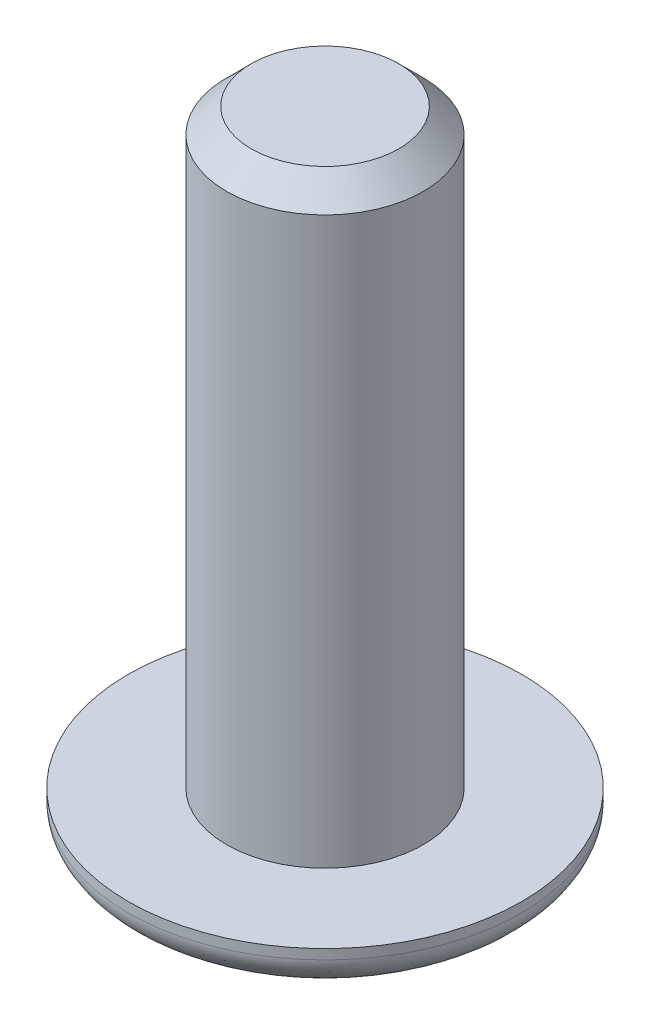
ISO-10303-21;
HEADER;
FILE_DESCRIPTION(('STEP AP214'),'2;1');
FILE_NAME('part.step','',(''),(''),'','','');
FILE_SCHEMA(('AUTOMOTIVE_DESIGN { 1 0 10303 214 1 1 1 1 }'));
ENDSEC;
DATA;
#1=APPLICATION_CONTEXT('core data for automotive mechanical design processes');
#2=APPLICATION_PROTOCOL_DEFINITION('international standard','automotive_design',2000,#1);
#3=PRODUCT_CONTEXT('',#1,'mechanical');
#4=PRODUCT('Part','Part','',(#3));
#5=PRODUCT_RELATED_PRODUCT_CATEGORY('part','',(#4));
#6=PRODUCT_DEFINITION_FORMATION('','',#4);
#7=PRODUCT_DEFINITION_CONTEXT('part definition',#1,'design');
#8=PRODUCT_DEFINITION('design','',#6,#7);
#9=PRODUCT_DEFINITION_SHAPE('','',#8);
#10=(LENGTH_UNIT() NAMED_UNIT(*) SI_UNIT(.MILLI.,.METRE.));
#11=(NAMED_UNIT(*) PLANE_ANGLE_UNIT() SI_UNIT($,.RADIAN.));
#12=(NAMED_UNIT(*) SI_UNIT($,.STERADIAN.) SOLID_ANGLE_UNIT());
#13=UNCERTAINTY_MEASURE_WITH_UNIT(LENGTH_MEASURE(1.E-05),#10,'distance_accuracy_value','');
#14=(GEOMETRIC_REPRESENTATION_CONTEXT(3) GLOBAL_UNCERTAINTY_ASSIGNED_CONTEXT((#13)) GLOBAL_UNIT_ASSIGNED_CONTEXT((#10,
#11,#12)) REPRESENTATION_CONTEXT('',''));
#15=CARTESIAN_POINT('',(0.,0.,0.));
#16=DIRECTION('',(0.,0.,1.));
#17=DIRECTION('',(1.,0.,0.));
#18=AXIS2_PLACEMENT_3D('',#15,#16,#17);
#19=CARTESIAN_POINT('',(0.,1.2,0.));
#20=DIRECTION('',(0.,1.,0.));
#21=DIRECTION('',(0.,0.,1.));
#22=AXIS2_PLACEMENT_3D('',#19,#20,#21);
#23=PLANE('',#22);
#24=CARTESIAN_POINT('',(0.,1.2,0.));
#25=DIRECTION('',(0.,1.,0.));
#26=DIRECTION('',(0.,0.,1.));
#27=AXIS2_PLACEMENT_3D('',#24,#25,#26);
#28=CIRCLE('',#27,2.);
#29=CARTESIAN_POINT('',(0.,1.2,2.));
#30=VERTEX_POINT('',#29);
#31=EDGE_CURVE('E297',#30,#30,#28,.T.);
#32=ORIENTED_EDGE('',*,*,#31,.F.);
#33=EDGE_LOOP('',(#32));
#34=FACE_BOUND('',#33,.T.);
#35=CARTESIAN_POINT('',(0.,1.2,0.));
#36=DIRECTION('',(0.,1.,0.));
#37=DIRECTION('',(0.,0.,1.));
#38=AXIS2_PLACEMENT_3D('',#35,#36,#37);
#39=CIRCLE('',#38,4.);
#40=CARTESIAN_POINT('',(0.,1.2,4.));
#41=VERTEX_POINT('',#40);
#42=EDGE_CURVE('E136',#41,#41,#39,.T.);
#43=ORIENTED_EDGE('',*,*,#42,.T.);
#44=EDGE_LOOP('',(#43));
#45=FACE_BOUND('',#44,.T.);
#46=ADVANCED_FACE('F41',(#34,#45),#23,.T.);
#47=CARTESIAN_POINT('',(0.,0.,0.));
#48=DIRECTION('',(0.,1.,0.));
#49=DIRECTION('',(0.,0.,1.));
#50=AXIS2_PLACEMENT_3D('',#47,#48,#49);
#51=PLANE('',#50);
#52=CARTESIAN_POINT('',(0.,0.,2.));
#53=CARTESIAN_POINT('',(0.261799376890833,0.,2.));
#54=CARTESIAN_POINT('',(0.523495778796538,0.,1.94794534916224));
#55=CARTESIAN_POINT('',(1.00723795066382,0.,1.74757278088291));
#56=CARTESIAN_POINT('',(1.22909344766315,0.,1.59933367708304));
#57=CARTESIAN_POINT('',(1.59933367708304,0.,1.22909344766315));
#58=CARTESIAN_POINT('',(1.74757278088293,0.,1.00723795066385));
#59=CARTESIAN_POINT('',(1.94794534916222,0.,0.52349577879651));
#60=CARTESIAN_POINT('',(2.,0.,0.261799376890842));
#61=CARTESIAN_POINT('',(2.,0.,-0.261799376890842));
#62=CARTESIAN_POINT('',(1.94794534916225,0.,-0.52349577879654));
#63=CARTESIAN_POINT('',(1.7475727808829,0.,-1.00723795066382));
#64=CARTESIAN_POINT('',(1.59933367708301,0.,-1.22909344766318));
#65=CARTESIAN_POINT('',(1.22909344766318,0.,-1.59933367708301));
#66=CARTESIAN_POINT('',(1.00723795066384,0.,-1.74757278088294));
#67=CARTESIAN_POINT('',(0.523495778796522,0.,-1.9479453491622));
#68=CARTESIAN_POINT('',(0.261799376890842,0.,-2.));
#69=CARTESIAN_POINT('',(-0.261799376890842,0.,-2.));
#70=CARTESIAN_POINT('',(-0.523495778796517,0.,-1.94794534916223));
#71=CARTESIAN_POINT('',(-1.00723795066384,0.,-1.74757278088292));
#72=CARTESIAN_POINT('',(-1.22909344766315,0.,-1.59933367708304));
#73=CARTESIAN_POINT('',(-1.59933367708304,0.,-1.22909344766315));
#74=CARTESIAN_POINT('',(-1.74757278088294,0.,-1.00723795066386));
#75=CARTESIAN_POINT('',(-1.94794534916221,0.,-0.523495778796506));
#76=CARTESIAN_POINT('',(-2.,0.,-0.261799376890839));
#77=CARTESIAN_POINT('',(-2.,0.,0.261799376890845));
#78=CARTESIAN_POINT('',(-1.94794534916221,0.,0.523495778796514));
#79=CARTESIAN_POINT('',(-1.74757278088294,0.,1.00723795066384));
#80=CARTESIAN_POINT('',(-1.59933367708301,0.,1.22909344766318));
#81=CARTESIAN_POINT('',(-1.22909344766319,0.,1.599333677083));
#82=CARTESIAN_POINT('',(-1.00723795066384,0.,1.74757278088294));
#83=CARTESIAN_POINT('',(-0.52349577879652,0.,1.94794534916221));
#84=CARTESIAN_POINT('',(-0.261799376890834,0.,2.));
#85=CARTESIAN_POINT('',(0.,0.,2.));
#86=(BOUNDED_CURVE() B_SPLINE_CURVE(3,(#52,#53,#54,#55,#56,#57,#58,#59,#60,#61,#62,#63,#64,#65,
#66,#67,#68,#69,#70,#71,#72,#73,#74,#75,#76,#77,#78,#79,#80,#81,#82,#83,#84,#85),.UNSPECIFIED.,
.T.,.F.) B_SPLINE_CURVE_WITH_KNOTS((4,2,2,2,2,2,2,2,2,2,2,2,2,2,2,2,4),(0.,0.392699081698724,
0.785398163397448,1.17809724509617,1.5707963267949,1.96349540849362,2.35619449019234,
2.74889357189107,3.14159265358979,3.53429173528852,3.92699081698724,4.31968989868597,
4.71238898038469,5.10508806208341,5.49778714378214,5.89048622548086,6.28318530717959),
.UNSPECIFIED.) CURVE() GEOMETRIC_REPRESENTATION_ITEM() RATIONAL_B_SPLINE_CURVE((1.,1.,1.,1.,1.,
1.,1.,1.,1.,1.,1.,1.,1.,1.,1.,1.,1.,1.,1.,1.,1.,1.,1.,1.,1.,1.,1.,1.,1.,1.,1.,1.,1.,1.)) REPRESENTATION_ITEM(''));
#87=CARTESIAN_POINT('',(0.,0.,2.));
#88=VERTEX_POINT('',#87);
#89=EDGE_CURVE('E12',#88,#88,#86,.F.);
#90=ORIENTED_EDGE('',*,*,#89,.T.);
#91=EDGE_LOOP('',(#90));
#92=FACE_BOUND('',#91,.T.);
#93=DIRECTION('',(0.5,0.,-0.866025403784439));
#94=VECTOR('',#93,1.);
#95=CARTESIAN_POINT('',(0.721687836487031,0.,1.25));
#96=LINE('',#95,#94);
#97=CARTESIAN_POINT('',(0.721687836487031,0.,1.25));
#98=VERTEX_POINT('',#97);
#99=CARTESIAN_POINT('',(1.44337567297406,0.,0.));
#100=VERTEX_POINT('',#99);
#101=EDGE_CURVE('E62',#98,#100,#96,.T.);
#102=ORIENTED_EDGE('',*,*,#101,.T.);
#103=DIRECTION('',(-0.5,0.,-0.866025403784439));
#104=VECTOR('',#103,1.);
#105=CARTESIAN_POINT('',(1.44337567297406,0.,0.));
#106=LINE('',#105,#104);
#107=CARTESIAN_POINT('',(0.721687836487031,0.,-1.25));
#108=VERTEX_POINT('',#107);
#109=EDGE_CURVE('E122',#100,#108,#106,.T.);
#110=ORIENTED_EDGE('',*,*,#109,.T.);
#111=DIRECTION('',(-1.,0.,0.));
#112=VECTOR('',#111,1.);
#113=CARTESIAN_POINT('',(0.721687836487031,0.,-1.25));
#114=LINE('',#113,#112);
#115=CARTESIAN_POINT('',(-0.721687836487033,0.,-1.25));
#116=VERTEX_POINT('',#115);
#117=EDGE_CURVE('E120',#108,#116,#114,.T.);
#118=ORIENTED_EDGE('',*,*,#117,.T.);
#119=DIRECTION('',(-0.5,0.,0.866025403784439));
#120=VECTOR('',#119,1.);
#121=CARTESIAN_POINT('',(-0.721687836487033,0.,-1.25));
#122=LINE('',#121,#120);
#123=CARTESIAN_POINT('',(-1.44337567297407,0.,0.));
#124=VERTEX_POINT('',#123);
#125=EDGE_CURVE('E98',#116,#124,#122,.T.);
#126=ORIENTED_EDGE('',*,*,#125,.T.);
#127=DIRECTION('',(0.5,0.,0.866025403784439));
#128=VECTOR('',#127,1.);
#129=CARTESIAN_POINT('',(-1.44337567297407,0.,0.));
#130=LINE('',#129,#128);
#131=CARTESIAN_POINT('',(-0.721687836487033,0.,1.25));
#132=VERTEX_POINT('',#131);
#133=EDGE_CURVE('E109',#124,#132,#130,.T.);
#134=ORIENTED_EDGE('',*,*,#133,.T.);
#135=DIRECTION('',(1.,0.,0.));
#136=VECTOR('',#135,1.);
#137=CARTESIAN_POINT('',(-0.721687836487033,0.,1.25));
#138=LINE('',#137,#136);
#139=EDGE_CURVE('E115',#132,#98,#138,.T.);
#140=ORIENTED_EDGE('',*,*,#139,.T.);
#141=EDGE_LOOP('',(#102,#110,#118,#126,#134,#140));
#142=FACE_BOUND('',#141,.T.);
#143=ADVANCED_FACE('F117',(#92,#142),#51,.F.);
#144=CARTESIAN_POINT('',(0.,1.2,0.));
#145=DIRECTION('',(0.,-1.,0.));
#146=DIRECTION('',(0.,0.,-1.));
#147=AXIS2_PLACEMENT_3D('',#144,#145,#146);
#148=CYLINDRICAL_SURFACE('',#147,4.);
#149=CARTESIAN_POINT('',(0.,1.,4.));
#150=CARTESIAN_POINT('',(-0.523598753781667,1.,4.));
#151=CARTESIAN_POINT('',(-1.04699155759304,1.,3.89589069832441));
#152=CARTESIAN_POINT('',(-2.01447590132769,1.,3.49514556176588));
#153=CARTESIAN_POINT('',(-2.45818689532638,1.,3.198667354166));
#154=CARTESIAN_POINT('',(-3.19866735416602,1.,2.45818689532636));
#155=CARTESIAN_POINT('',(-3.49514556176589,1.,2.01447590132768));
#156=CARTESIAN_POINT('',(-3.89589069832441,1.,1.04699155759303));
#157=CARTESIAN_POINT('',(-4.,1.,0.523598753781691));
#158=CARTESIAN_POINT('',(-4.,1.,-0.523598753781678));
#159=CARTESIAN_POINT('',(-3.89589069832442,1.,-1.04699155759301));
#160=CARTESIAN_POINT('',(-3.49514556176587,1.,-2.01447590132771));
#161=CARTESIAN_POINT('',(-3.19866735416608,1.,-2.4581868953263));
#162=CARTESIAN_POINT('',(-2.4581868953263,1.,-3.19866735416608));
#163=CARTESIAN_POINT('',(-2.01447590132769,1.,-3.49514556176588));
#164=CARTESIAN_POINT('',(-1.04699155759301,1.,-3.89589069832442));
#165=CARTESIAN_POINT('',(-0.523598753781683,1.,-4.));
#166=CARTESIAN_POINT('',(0.523598753781684,1.,-4.));
#167=CARTESIAN_POINT('',(1.04699155759304,1.,-3.89589069832441));
#168=CARTESIAN_POINT('',(2.01447590132768,1.,-3.49514556176588));
#169=CARTESIAN_POINT('',(2.45818689532636,1.,-3.19866735416603));
#170=CARTESIAN_POINT('',(3.19866735416602,1.,-2.45818689532636));
#171=CARTESIAN_POINT('',(3.49514556176589,1.,-2.01447590132768));
#172=CARTESIAN_POINT('',(3.89589069832441,1.,-1.04699155759304));
#173=CARTESIAN_POINT('',(4.,1.,-0.523598753781683));
#174=CARTESIAN_POINT('',(4.,1.,0.523598753781684));
#175=CARTESIAN_POINT('',(3.89589069832442,1.,1.04699155759301));
#176=CARTESIAN_POINT('',(3.49514556176588,1.,2.0144759013277));
#177=CARTESIAN_POINT('',(3.19866735416607,1.,2.45818689532631));
#178=CARTESIAN_POINT('',(2.45818689532631,1.,3.19866735416607));
#179=CARTESIAN_POINT('',(2.01447590132769,1.,3.49514556176588));
#180=CARTESIAN_POINT('',(1.04699155759303,1.,3.89589069832441));
#181=CARTESIAN_POINT('',(0.523598753781667,1.,4.));
#182=CARTESIAN_POINT('',(0.,1.,4.));
#183=(BOUNDED_CURVE() B_SPLINE_CURVE(3,(#149,#150,#151,#152,#153,#154,#155,#156,#157,#158,#159,
#160,#161,#162,#163,#164,#165,#166,#167,#168,#169,#170,#171,#172,#173,#174,#175,#176,#177,#178,
#179,#180,#181,#182),.UNSPECIFIED.,.T.,.F.) B_SPLINE_CURVE_WITH_KNOTS((4,2,2,2,2,2,2,2,2,2,2,2,
2,2,2,2,4),(0.,0.392699081698725,0.785398163397448,1.17809724509617,1.5707963267949,
1.96349540849362,2.35619449019234,2.74889357189107,3.14159265358979,3.53429173528852,
3.92699081698724,4.31968989868597,4.71238898038469,5.10508806208341,5.49778714378214,
5.89048622548086,6.28318530717959),
.UNSPECIFIED.) CURVE() GEOMETRIC_REPRESENTATION_ITEM() RATIONAL_B_SPLINE_CURVE((1.,1.,1.,1.,1.,
1.,1.,1.,1.,1.,1.,1.,1.,1.,1.,1.,1.,1.,1.,1.,1.,1.,1.,1.,1.,1.,1.,1.,1.,1.,1.,1.,1.,1.)) REPRESENTATION_ITEM(''));
#184=CARTESIAN_POINT('',(0.,1.,4.));
#185=VERTEX_POINT('',#184);
#186=EDGE_CURVE('E55',#185,#185,#183,.F.);
#187=ORIENTED_EDGE('',*,*,#186,.T.);
#188=EDGE_LOOP('',(#187));
#189=FACE_BOUND('',#188,.T.);
#190=ORIENTED_EDGE('',*,*,#42,.F.);
#191=EDGE_LOOP('',(#190));
#192=FACE_BOUND('',#191,.T.);
#193=ADVANCED_FACE('F154',(#189,#192),#148,.T.);
#194=CARTESIAN_POINT('',(0.721687836487031,1.2,1.25));
#195=DIRECTION('',(-0.866025403784439,0.,-0.5));
#196=DIRECTION('',(-0.5,0.,0.866025403784439));
#197=AXIS2_PLACEMENT_3D('',#194,#195,#196);
#198=PLANE('',#197);
#199=ORIENTED_EDGE('',*,*,#101,.F.);
#200=DIRECTION('',(0.,-1.,0.));
#201=VECTOR('',#200,1.);
#202=CARTESIAN_POINT('',(0.721687836487031,1.2,1.25));
#203=LINE('',#202,#201);
#204=CARTESIAN_POINT('',(0.721687836487031,1.2,1.25));
#205=VERTEX_POINT('',#204);
#206=EDGE_CURVE('E127',#205,#98,#203,.T.);
#207=ORIENTED_EDGE('',*,*,#206,.F.);
#208=DIRECTION('',(0.5,0.,-0.866025403784439));
#209=VECTOR('',#208,1.);
#210=CARTESIAN_POINT('',(0.721687836487031,1.2,1.25));
#211=LINE('',#210,#209);
#212=CARTESIAN_POINT('',(1.44337567297406,1.2,0.));
#213=VERTEX_POINT('',#212);
#214=EDGE_CURVE('E71',#205,#213,#211,.T.);
#215=ORIENTED_EDGE('',*,*,#214,.T.);
#216=DIRECTION('',(0.,-1.,0.));
#217=VECTOR('',#216,1.);
#218=CARTESIAN_POINT('',(1.44337567297406,1.2,0.));
#219=LINE('',#218,#217);
#220=EDGE_CURVE('E134',#213,#100,#219,.T.);
#221=ORIENTED_EDGE('',*,*,#220,.T.);
#222=EDGE_LOOP('',(#199,#207,#215,#221));
#223=FACE_BOUND('',#222,.T.);
#224=ADVANCED_FACE('F163',(#223),#198,.T.);
#225=CARTESIAN_POINT('',(1.44337567297406,1.2,0.));
#226=DIRECTION('',(-0.866025403784439,0.,0.5));
#227=DIRECTION('',(0.5,0.,0.866025403784439));
#228=AXIS2_PLACEMENT_3D('',#225,#226,#227);
#229=PLANE('',#228);
#230=ORIENTED_EDGE('',*,*,#109,.F.);
#231=ORIENTED_EDGE('',*,*,#220,.F.);
#232=DIRECTION('',(-0.5,0.,-0.866025403784439));
#233=VECTOR('',#232,1.);
#234=CARTESIAN_POINT('',(1.44337567297406,1.2,0.));
#235=LINE('',#234,#233);
#236=CARTESIAN_POINT('',(0.721687836487031,1.2,-1.25));
#237=VERTEX_POINT('',#236);
#238=EDGE_CURVE('E302',#213,#237,#235,.T.);
#239=ORIENTED_EDGE('',*,*,#238,.T.);
#240=DIRECTION('',(0.,-1.,0.));
#241=VECTOR('',#240,1.);
#242=CARTESIAN_POINT('',(0.721687836487031,1.2,-1.25));
#243=LINE('',#242,#241);
#244=EDGE_CURVE('E132',#237,#108,#243,.T.);
#245=ORIENTED_EDGE('',*,*,#244,.T.);
#246=EDGE_LOOP('',(#230,#231,#239,#245));
#247=FACE_BOUND('',#246,.T.);
#248=ADVANCED_FACE('F194',(#247),#229,.T.);
#249=CARTESIAN_POINT('',(0.721687836487031,1.2,-1.25));
#250=DIRECTION('',(0.,0.,1.));
#251=DIRECTION('',(1.,0.,0.));
#252=AXIS2_PLACEMENT_3D('',#249,#250,#251);
#253=PLANE('',#252);
#254=ORIENTED_EDGE('',*,*,#117,.F.);
#255=ORIENTED_EDGE('',*,*,#244,.F.);
#256=DIRECTION('',(-1.,0.,0.));
#257=VECTOR('',#256,1.);
#258=CARTESIAN_POINT('',(0.721687836487031,1.2,-1.25));
#259=LINE('',#258,#257);
#260=CARTESIAN_POINT('',(-0.721687836487033,1.2,-1.25));
#261=VERTEX_POINT('',#260);
#262=EDGE_CURVE('E305',#237,#261,#259,.T.);
#263=ORIENTED_EDGE('',*,*,#262,.T.);
#264=DIRECTION('',(0.,-1.,0.));
#265=VECTOR('',#264,1.);
#266=CARTESIAN_POINT('',(-0.721687836487033,1.2,-1.25));
#267=LINE('',#266,#265);
#268=EDGE_CURVE('E105',#261,#116,#267,.T.);
#269=ORIENTED_EDGE('',*,*,#268,.T.);
#270=EDGE_LOOP('',(#254,#255,#263,#269));
#271=FACE_BOUND('',#270,.T.);
#272=ADVANCED_FACE('F197',(#271),#253,.T.);
#273=CARTESIAN_POINT('',(-0.721687836487033,1.2,-1.25));
#274=DIRECTION('',(0.866025403784439,0.,0.5));
#275=DIRECTION('',(0.5,0.,-0.866025403784439));
#276=AXIS2_PLACEMENT_3D('',#273,#274,#275);
#277=PLANE('',#276);
#278=ORIENTED_EDGE('',*,*,#125,.F.);
#279=ORIENTED_EDGE('',*,*,#268,.F.);
#280=DIRECTION('',(-0.5,0.,0.866025403784439));
#281=VECTOR('',#280,1.);
#282=CARTESIAN_POINT('',(-0.721687836487033,1.2,-1.25));
#283=LINE('',#282,#281);
#284=CARTESIAN_POINT('',(-1.44337567297407,1.2,0.));
#285=VERTEX_POINT('',#284);
#286=EDGE_CURVE('E102',#261,#285,#283,.T.);
#287=ORIENTED_EDGE('',*,*,#286,.T.);
#288=DIRECTION('',(0.,-1.,0.));
#289=VECTOR('',#288,1.);
#290=CARTESIAN_POINT('',(-1.44337567297407,1.2,0.));
#291=LINE('',#290,#289);
#292=EDGE_CURVE('E93',#285,#124,#291,.T.);
#293=ORIENTED_EDGE('',*,*,#292,.T.);
#294=EDGE_LOOP('',(#278,#279,#287,#293));
#295=FACE_BOUND('',#294,.T.);
#296=ADVANCED_FACE('F95',(#295),#277,.T.);
#297=CARTESIAN_POINT('',(-1.44337567297407,1.2,0.));
#298=DIRECTION('',(0.866025403784439,0.,-0.5));
#299=DIRECTION('',(-0.5,0.,-0.866025403784439));
#300=AXIS2_PLACEMENT_3D('',#297,#298,#299);
#301=PLANE('',#300);
#302=ORIENTED_EDGE('',*,*,#133,.F.);
#303=ORIENTED_EDGE('',*,*,#292,.F.);
#304=DIRECTION('',(0.5,0.,0.866025403784439));
#305=VECTOR('',#304,1.);
#306=CARTESIAN_POINT('',(-1.44337567297407,1.2,0.));
#307=LINE('',#306,#305);
#308=CARTESIAN_POINT('',(-0.721687836487033,1.2,1.25));
#309=VERTEX_POINT('',#308);
#310=EDGE_CURVE('E309',#285,#309,#307,.T.);
#311=ORIENTED_EDGE('',*,*,#310,.T.);
#312=DIRECTION('',(0.,-1.,0.));
#313=VECTOR('',#312,1.);
#314=CARTESIAN_POINT('',(-0.721687836487033,1.2,1.25));
#315=LINE('',#314,#313);
#316=EDGE_CURVE('E106',#309,#132,#315,.T.);
#317=ORIENTED_EDGE('',*,*,#316,.T.);
#318=EDGE_LOOP('',(#302,#303,#311,#317));
#319=FACE_BOUND('',#318,.T.);
#320=ADVANCED_FACE('F110',(#319),#301,.T.);
#321=CARTESIAN_POINT('',(-0.721687836487033,1.2,1.25));
#322=DIRECTION('',(0.,0.,-1.));
#323=DIRECTION('',(-1.,0.,0.));
#324=AXIS2_PLACEMENT_3D('',#321,#322,#323);
#325=PLANE('',#324);
#326=ORIENTED_EDGE('',*,*,#139,.F.);
#327=ORIENTED_EDGE('',*,*,#316,.F.);
#328=DIRECTION('',(1.,0.,0.));
#329=VECTOR('',#328,1.);
#330=CARTESIAN_POINT('',(-0.721687836487033,1.2,1.25));
#331=LINE('',#330,#329);
#332=EDGE_CURVE('E129',#309,#205,#331,.T.);
#333=ORIENTED_EDGE('',*,*,#332,.T.);
#334=ORIENTED_EDGE('',*,*,#206,.T.);
#335=EDGE_LOOP('',(#326,#327,#333,#334));
#336=FACE_BOUND('',#335,.T.);
#337=ADVANCED_FACE('F206',(#336),#325,.T.);
#338=CARTESIAN_POINT('',(0.,1.2,0.));
#339=DIRECTION('',(0.,1.,0.));
#340=DIRECTION('',(0.,0.,1.));
#341=AXIS2_PLACEMENT_3D('',#338,#339,#340);
#342=PLANE('',#341);
#343=ORIENTED_EDGE('',*,*,#214,.F.);
#344=ORIENTED_EDGE('',*,*,#332,.F.);
#345=ORIENTED_EDGE('',*,*,#310,.F.);
#346=ORIENTED_EDGE('',*,*,#286,.F.);
#347=ORIENTED_EDGE('',*,*,#262,.F.);
#348=ORIENTED_EDGE('',*,*,#238,.F.);
#349=EDGE_LOOP('',(#343,#344,#345,#346,#347,#348));
#350=FACE_BOUND('',#349,.T.);
#351=ADVANCED_FACE('F209',(#350),#342,.F.);
#352=CARTESIAN_POINT('',(0.,13.2,0.));
#353=DIRECTION('',(0.,-1.,0.));
#354=DIRECTION('',(0.,0.,-1.));
#355=AXIS2_PLACEMENT_3D('',#352,#353,#354);
#356=CYLINDRICAL_SURFACE('',#355,2.);
#357=CARTESIAN_POINT('',(0.,12.7,0.));
#358=DIRECTION('',(0.,1.,0.));
#359=DIRECTION('',(0.,0.,1.));
#360=AXIS2_PLACEMENT_3D('',#357,#358,#359);
#361=CIRCLE('',#360,2.);
#362=CARTESIAN_POINT('',(0.,12.7,2.));
#363=VERTEX_POINT('',#362);
#364=EDGE_CURVE('E142',#363,#363,#361,.F.);
#365=ORIENTED_EDGE('',*,*,#364,.T.);
#366=EDGE_LOOP('',(#365));
#367=FACE_BOUND('',#366,.T.);
#368=ORIENTED_EDGE('',*,*,#31,.T.);
#369=EDGE_LOOP('',(#368));
#370=FACE_BOUND('',#369,.T.);
#371=ADVANCED_FACE('F178',(#367,#370),#356,.T.);
#372=CARTESIAN_POINT('',(0.,13.2,0.));
#373=DIRECTION('',(0.,1.,0.));
#374=DIRECTION('',(0.,0.,1.));
#375=AXIS2_PLACEMENT_3D('',#372,#373,#374);
#376=PLANE('',#375);
#377=CARTESIAN_POINT('',(0.,13.2,0.));
#378=DIRECTION('',(0.,1.,0.));
#379=DIRECTION('',(0.,0.,1.));
#380=AXIS2_PLACEMENT_3D('',#377,#378,#379);
#381=CIRCLE('',#380,1.5);
#382=CARTESIAN_POINT('',(0.,13.2,1.5));
#383=VERTEX_POINT('',#382);
#384=EDGE_CURVE('E139',#383,#383,#381,.T.);
#385=ORIENTED_EDGE('',*,*,#384,.T.);
#386=EDGE_LOOP('',(#385));
#387=FACE_BOUND('',#386,.T.);
#388=ADVANCED_FACE('F171',(#387),#376,.T.);
#389=CARTESIAN_POINT('',(0.,13.2,0.));
#390=DIRECTION('',(0.,-1.,0.));
#391=DIRECTION('',(0.,0.,-1.));
#392=AXIS2_PLACEMENT_3D('',#389,#390,#391);
#393=CONICAL_SURFACE('',#392,1.5,0.785398163397447);
#394=ORIENTED_EDGE('',*,*,#364,.F.);
#395=EDGE_LOOP('',(#394));
#396=FACE_BOUND('',#395,.T.);
#397=ORIENTED_EDGE('',*,*,#384,.F.);
#398=EDGE_LOOP('',(#397));
#399=FACE_BOUND('',#398,.T.);
#400=ADVANCED_FACE('F167',(#396,#399),#393,.T.);
#401=CARTESIAN_POINT('',(0.,1.,4.));
#402=CARTESIAN_POINT('',(0.523598753781667,1.,4.));
#403=CARTESIAN_POINT('',(1.04699155759303,1.,3.89589069832441));
#404=CARTESIAN_POINT('',(2.01447590132769,1.,3.49514556176588));
#405=CARTESIAN_POINT('',(2.45818689532631,1.,3.19866735416607));
#406=CARTESIAN_POINT('',(3.19866735416607,1.,2.45818689532631));
#407=CARTESIAN_POINT('',(3.49514556176588,1.,2.0144759013277));
#408=CARTESIAN_POINT('',(3.89589069832442,1.,1.04699155759301));
#409=CARTESIAN_POINT('',(4.,1.,0.523598753781684));
#410=CARTESIAN_POINT('',(4.,1.,-0.523598753781683));
#411=CARTESIAN_POINT('',(3.89589069832441,1.,-1.04699155759304));
#412=CARTESIAN_POINT('',(3.49514556176589,1.,-2.01447590132768));
#413=CARTESIAN_POINT('',(3.19866735416602,1.,-2.45818689532636));
#414=CARTESIAN_POINT('',(2.45818689532636,1.,-3.19866735416603));
#415=CARTESIAN_POINT('',(2.01447590132768,1.,-3.49514556176588));
#416=CARTESIAN_POINT('',(1.04699155759304,1.,-3.89589069832441));
#417=CARTESIAN_POINT('',(0.523598753781684,1.,-4.));
#418=CARTESIAN_POINT('',(-0.523598753781683,1.,-4.));
#419=CARTESIAN_POINT('',(-1.04699155759301,1.,-3.89589069832442));
#420=CARTESIAN_POINT('',(-2.01447590132769,1.,-3.49514556176588));
#421=CARTESIAN_POINT('',(-2.4581868953263,1.,-3.19866735416608));
#422=CARTESIAN_POINT('',(-3.19866735416608,1.,-2.4581868953263));
#423=CARTESIAN_POINT('',(-3.49514556176587,1.,-2.01447590132771));
#424=CARTESIAN_POINT('',(-3.89589069832442,1.,-1.04699155759301));
#425=CARTESIAN_POINT('',(-4.,1.,-0.523598753781678));
#426=CARTESIAN_POINT('',(-4.,1.,0.523598753781691));
#427=CARTESIAN_POINT('',(-3.89589069832441,1.,1.04699155759303));
#428=CARTESIAN_POINT('',(-3.49514556176589,1.,2.01447590132768));
#429=CARTESIAN_POINT('',(-3.19866735416602,1.,2.45818689532636));
#430=CARTESIAN_POINT('',(-2.45818689532638,1.,3.198667354166));
#431=CARTESIAN_POINT('',(-2.01447590132769,1.,3.49514556176588));
#432=CARTESIAN_POINT('',(-1.04699155759304,1.,3.89589069832441));
#433=CARTESIAN_POINT('',(-0.523598753781667,1.,4.));
#434=CARTESIAN_POINT('',(0.,1.,4.));
#435=CARTESIAN_POINT('',(0.,0.,4.));
#436=CARTESIAN_POINT('',(0.523598753781667,0.,4.));
#437=CARTESIAN_POINT('',(1.04699155759308,0.,3.89589069832453));
#438=CARTESIAN_POINT('',(2.01447590132764,0.,3.49514556176576));
#439=CARTESIAN_POINT('',(2.45818689532636,0.,3.19866735416602));
#440=CARTESIAN_POINT('',(3.19866735416602,0.,2.45818689532636));
#441=CARTESIAN_POINT('',(3.49514556176586,0.,2.01447590132772));
#442=CARTESIAN_POINT('',(3.89589069832444,0.,1.04699155759299));
#443=CARTESIAN_POINT('',(4.,0.,0.523598753781684));
#444=CARTESIAN_POINT('',(4.,0.,-0.523598753781683));
#445=CARTESIAN_POINT('',(3.89589069832444,0.,-1.04699155759302));
#446=CARTESIAN_POINT('',(3.49514556176585,0.,-2.0144759013277));
#447=CARTESIAN_POINT('',(3.19866735416602,0.,-2.4581868953263));
#448=CARTESIAN_POINT('',(2.45818689532636,0.,-3.19866735416608));
#449=CARTESIAN_POINT('',(2.01447590132768,0.,-3.49514556176594));
#450=CARTESIAN_POINT('',(1.04699155759304,0.,-3.89589069832435));
#451=CARTESIAN_POINT('',(0.523598753781684,0.,-4.));
#452=CARTESIAN_POINT('',(-0.523598753781683,0.,-4.));
#453=CARTESIAN_POINT('',(-1.04699155759303,0.,-3.89589069832447));
#454=CARTESIAN_POINT('',(-2.01447590132767,0.,-3.49514556176583));
#455=CARTESIAN_POINT('',(-2.4581868953263,0.,-3.19866735416614));
#456=CARTESIAN_POINT('',(-3.19866735416608,0.,-2.45818689532624));
#457=CARTESIAN_POINT('',(-3.49514556176576,0.,-2.01447590132774));
#458=CARTESIAN_POINT('',(-3.89589069832453,0.,-1.04699155759298));
#459=CARTESIAN_POINT('',(-4.,0.,-0.523598753781678));
#460=CARTESIAN_POINT('',(-4.,0.,0.523598753781691));
#461=CARTESIAN_POINT('',(-3.89589069832447,0.,1.04699155759303));
#462=CARTESIAN_POINT('',(-3.49514556176582,0.,2.01447590132768));
#463=CARTESIAN_POINT('',(-3.19866735416596,0.,2.45818689532636));
#464=CARTESIAN_POINT('',(-2.45818689532643,0.,3.198667354166));
#465=CARTESIAN_POINT('',(-2.01447590132766,0.,3.49514556176576));
#466=CARTESIAN_POINT('',(-1.04699155759307,0.,3.89589069832453));
#467=CARTESIAN_POINT('',(-0.523598753781667,0.,4.));
#468=CARTESIAN_POINT('',(0.,0.,4.));
#469=CARTESIAN_POINT('',(0.,0.,2.));
#470=CARTESIAN_POINT('',(0.261799376890833,0.,2.));
#471=CARTESIAN_POINT('',(0.523495778796538,0.,1.94794534916224));
#472=CARTESIAN_POINT('',(1.00723795066382,0.,1.74757278088291));
#473=CARTESIAN_POINT('',(1.22909344766315,0.,1.59933367708304));
#474=CARTESIAN_POINT('',(1.59933367708304,0.,1.22909344766315));
#475=CARTESIAN_POINT('',(1.74757278088293,0.,1.00723795066385));
#476=CARTESIAN_POINT('',(1.94794534916222,0.,0.52349577879651));
#477=CARTESIAN_POINT('',(2.,0.,0.261799376890842));
#478=CARTESIAN_POINT('',(2.,0.,-0.261799376890842));
#479=CARTESIAN_POINT('',(1.94794534916225,0.,-0.52349577879654));
#480=CARTESIAN_POINT('',(1.7475727808829,0.,-1.00723795066382));
#481=CARTESIAN_POINT('',(1.59933367708301,0.,-1.22909344766318));
#482=CARTESIAN_POINT('',(1.22909344766318,0.,-1.59933367708301));
#483=CARTESIAN_POINT('',(1.00723795066384,0.,-1.74757278088294));
#484=CARTESIAN_POINT('',(0.523495778796522,0.,-1.9479453491622));
#485=CARTESIAN_POINT('',(0.261799376890842,0.,-2.));
#486=CARTESIAN_POINT('',(-0.261799376890842,0.,-2.));
#487=CARTESIAN_POINT('',(-0.523495778796517,0.,-1.94794534916223));
#488=CARTESIAN_POINT('',(-1.00723795066384,0.,-1.74757278088292));
#489=CARTESIAN_POINT('',(-1.22909344766315,0.,-1.59933367708304));
#490=CARTESIAN_POINT('',(-1.59933367708304,0.,-1.22909344766315));
#491=CARTESIAN_POINT('',(-1.74757278088294,0.,-1.00723795066386));
#492=CARTESIAN_POINT('',(-1.94794534916221,0.,-0.523495778796506));
#493=CARTESIAN_POINT('',(-2.,0.,-0.261799376890839));
#494=CARTESIAN_POINT('',(-2.,0.,0.261799376890845));
#495=CARTESIAN_POINT('',(-1.94794534916221,0.,0.523495778796514));
#496=CARTESIAN_POINT('',(-1.74757278088294,0.,1.00723795066384));
#497=CARTESIAN_POINT('',(-1.59933367708301,0.,1.22909344766318));
#498=CARTESIAN_POINT('',(-1.22909344766319,0.,1.599333677083));
#499=CARTESIAN_POINT('',(-1.00723795066384,0.,1.74757278088294));
#500=CARTESIAN_POINT('',(-0.52349577879652,0.,1.94794534916221));
#501=CARTESIAN_POINT('',(-0.261799376890834,0.,2.));
#502=CARTESIAN_POINT('',(0.,0.,2.));
#503=(BOUNDED_SURFACE() B_SPLINE_SURFACE(2,3,((#401,#402,#403,#404,#405,#406,#407,#408,#409,
#410,#411,#412,#413,#414,#415,#416,#417,#418,#419,#420,#421,#422,#423,#424,#425,#426,#427,#428,
#429,#430,#431,#432,#433,#434),(#435,#436,#437,#438,#439,#440,#441,#442,#443,#444,#445,#446,
#447,#448,#449,#450,#451,#452,#453,#454,#455,#456,#457,#458,#459,#460,#461,#462,#463,#464,#465,
#466,#467,#468),(#469,#470,#471,#472,#473,#474,#475,#476,#477,#478,#479,#480,#481,#482,#483,
#484,#485,#486,#487,#488,#489,#490,#491,#492,#493,#494,#495,#496,#497,#498,#499,#500,#501,
#502)),.UNSPECIFIED.,.F.,.T.,.F.) B_SPLINE_SURFACE_WITH_KNOTS((3,3),(4,2,2,2,2,2,2,2,2,2,2,2,2,
2,2,2,4),(0.,1.),(0.,0.392699081698724,0.785398163397448,1.17809724509617,1.5707963267949,
1.96349540849362,2.35619449019234,2.74889357189107,3.14159265358979,3.53429173528852,
3.92699081698724,4.31968989868597,4.71238898038469,5.10508806208341,5.49778714378214,
5.89048622548086,6.28318530717959),
.UNSPECIFIED.) GEOMETRIC_REPRESENTATION_ITEM() RATIONAL_B_SPLINE_SURFACE(((1.,1.,1.,1.,1.,1.,1.,
1.,1.,1.,1.,1.,1.,1.,1.,1.,1.,1.,1.,1.,1.,1.,1.,1.,1.,1.,1.,1.,1.,1.,1.,1.,1.,1.),
(0.707106781186548,0.707106781186548,0.707106781186548,0.707106781186548,0.707106781186548,
0.707106781186548,0.707106781186548,0.707106781186548,0.707106781186548,0.707106781186548,
0.707106781186548,0.707106781186548,0.707106781186548,0.707106781186548,0.707106781186548,
0.707106781186548,0.707106781186548,0.707106781186548,0.707106781186548,0.707106781186548,
0.707106781186548,0.707106781186548,0.707106781186548,0.707106781186548,0.707106781186548,
0.707106781186548,0.707106781186548,0.707106781186548,0.707106781186547,0.707106781186547,
0.707106781186548,0.707106781186548,0.707106781186548,0.707106781186548),(1.,1.,1.,1.,1.,1.,1.,
1.,1.,1.,1.,1.,1.,1.,1.,1.,1.,1.,1.,1.,1.,1.,1.,1.,1.,1.,1.,1.,1.,1.,1.,1.,1.,1.))) REPRESENTATION_ITEM('') SURFACE());
#504=ORIENTED_EDGE('',*,*,#89,.F.);
#505=EDGE_LOOP('',(#504));
#506=FACE_BOUND('',#505,.T.);
#507=ORIENTED_EDGE('',*,*,#186,.F.);
#508=EDGE_LOOP('',(#507));
#509=FACE_BOUND('',#508,.T.);
#510=ADVANCED_FACE('F44',(#506,#509),#503,.T.);
#511=CLOSED_SHELL('',(#46,#143,#193,#224,#248,#272,#296,#320,#337,#351,#371,#388,#400,#510));
#512=MANIFOLD_SOLID_BREP('B2',#511);
#513=ADVANCED_BREP_SHAPE_REPRESENTATION('',(#18,#512),#14);
#514=SHAPE_DEFINITION_REPRESENTATION(#9,#513);
ENDSEC;
END-ISO-10303-21;
